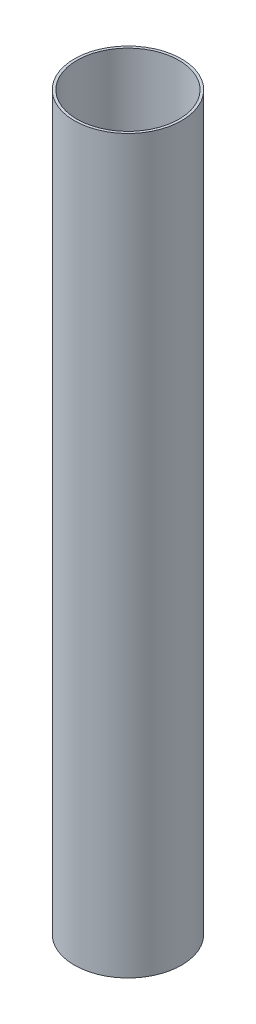
ISO-10303-21;
HEADER;
FILE_DESCRIPTION(('STEP AP214'),'2;1');
FILE_NAME('part.step','',(''),(''),'','','');
FILE_SCHEMA(('AUTOMOTIVE_DESIGN { 1 0 10303 214 1 1 1 1 }'));
ENDSEC;
DATA;
#1=APPLICATION_CONTEXT('core data for automotive mechanical design processes');
#2=APPLICATION_PROTOCOL_DEFINITION('international standard','automotive_design',2000,#1);
#3=PRODUCT_CONTEXT('',#1,'mechanical');
#4=PRODUCT('Part','Part','',(#3));
#5=PRODUCT_RELATED_PRODUCT_CATEGORY('part','',(#4));
#6=PRODUCT_DEFINITION_FORMATION('','',#4);
#7=PRODUCT_DEFINITION_CONTEXT('part definition',#1,'design');
#8=PRODUCT_DEFINITION('design','',#6,#7);
#9=PRODUCT_DEFINITION_SHAPE('','',#8);
#10=(LENGTH_UNIT() NAMED_UNIT(*) SI_UNIT(.MILLI.,.METRE.));
#11=(NAMED_UNIT(*) PLANE_ANGLE_UNIT() SI_UNIT($,.RADIAN.));
#12=(NAMED_UNIT(*) SI_UNIT($,.STERADIAN.) SOLID_ANGLE_UNIT());
#13=UNCERTAINTY_MEASURE_WITH_UNIT(LENGTH_MEASURE(1.E-05),#10,'distance_accuracy_value','');
#14=(GEOMETRIC_REPRESENTATION_CONTEXT(3) GLOBAL_UNCERTAINTY_ASSIGNED_CONTEXT((#13)) GLOBAL_UNIT_ASSIGNED_CONTEXT((#10,
#11,#12)) REPRESENTATION_CONTEXT('',''));
#15=CARTESIAN_POINT('',(0.,0.,0.));
#16=DIRECTION('',(0.,0.,1.));
#17=DIRECTION('',(1.,0.,0.));
#18=AXIS2_PLACEMENT_3D('',#15,#16,#17);
#19=CARTESIAN_POINT('',(0.,546.1,0.));
#20=DIRECTION('',(0.,-1.,0.));
#21=DIRECTION('',(0.,0.,-1.));
#22=AXIS2_PLACEMENT_3D('',#19,#20,#21);
#23=CYLINDRICAL_SURFACE('',#22,40.005);
#24=CARTESIAN_POINT('',(0.,546.1,0.));
#25=DIRECTION('',(0.,1.,0.));
#26=DIRECTION('',(0.,0.,1.));
#27=AXIS2_PLACEMENT_3D('',#24,#25,#26);
#28=CIRCLE('',#27,40.005);
#29=CARTESIAN_POINT('',(0.,546.1,40.005));
#30=VERTEX_POINT('',#29);
#31=EDGE_CURVE('E10',#30,#30,#28,.T.);
#32=ORIENTED_EDGE('',*,*,#31,.F.);
#33=EDGE_LOOP('',(#32));
#34=FACE_BOUND('',#33,.T.);
#35=CARTESIAN_POINT('',(0.,0.,0.));
#36=DIRECTION('',(0.,1.,0.));
#37=DIRECTION('',(0.,0.,1.));
#38=AXIS2_PLACEMENT_3D('',#35,#36,#37);
#39=CIRCLE('',#38,40.005);
#40=CARTESIAN_POINT('',(0.,0.,40.005));
#41=VERTEX_POINT('',#40);
#42=EDGE_CURVE('E43',#41,#41,#39,.T.);
#43=ORIENTED_EDGE('',*,*,#42,.T.);
#44=EDGE_LOOP('',(#43));
#45=FACE_BOUND('',#44,.T.);
#46=ADVANCED_FACE('F40',(#34,#45),#23,.T.);
#47=CARTESIAN_POINT('',(0.,546.1,0.));
#48=DIRECTION('',(0.,1.,0.));
#49=DIRECTION('',(0.,0.,1.));
#50=AXIS2_PLACEMENT_3D('',#47,#48,#49);
#51=PLANE('',#50);
#52=CARTESIAN_POINT('',(0.,546.1,0.));
#53=DIRECTION('',(0.,1.,0.));
#54=DIRECTION('',(0.,0.,1.));
#55=AXIS2_PLACEMENT_3D('',#52,#53,#54);
#56=CIRCLE('',#55,38.1);
#57=CARTESIAN_POINT('',(0.,546.1,38.1));
#58=VERTEX_POINT('',#57);
#59=EDGE_CURVE('E54',#58,#58,#56,.T.);
#60=ORIENTED_EDGE('',*,*,#59,.F.);
#61=EDGE_LOOP('',(#60));
#62=FACE_BOUND('',#61,.T.);
#63=ORIENTED_EDGE('',*,*,#31,.T.);
#64=EDGE_LOOP('',(#63));
#65=FACE_BOUND('',#64,.T.);
#66=ADVANCED_FACE('F71',(#62,#65),#51,.T.);
#67=CARTESIAN_POINT('',(0.,0.,0.));
#68=DIRECTION('',(0.,1.,0.));
#69=DIRECTION('',(0.,0.,1.));
#70=AXIS2_PLACEMENT_3D('',#67,#68,#69);
#71=PLANE('',#70);
#72=CARTESIAN_POINT('',(0.,0.,0.));
#73=DIRECTION('',(0.,1.,0.));
#74=DIRECTION('',(0.,0.,1.));
#75=AXIS2_PLACEMENT_3D('',#72,#73,#74);
#76=CIRCLE('',#75,38.1);
#77=CARTESIAN_POINT('',(0.,0.,38.1));
#78=VERTEX_POINT('',#77);
#79=EDGE_CURVE('E52',#78,#78,#76,.T.);
#80=ORIENTED_EDGE('',*,*,#79,.T.);
#81=EDGE_LOOP('',(#80));
#82=FACE_BOUND('',#81,.T.);
#83=ORIENTED_EDGE('',*,*,#42,.F.);
#84=EDGE_LOOP('',(#83));
#85=FACE_BOUND('',#84,.T.);
#86=ADVANCED_FACE('F62',(#82,#85),#71,.F.);
#87=CARTESIAN_POINT('',(0.,0.,0.));
#88=DIRECTION('',(0.,1.,0.));
#89=DIRECTION('',(0.,0.,1.));
#90=AXIS2_PLACEMENT_3D('',#87,#88,#89);
#91=CYLINDRICAL_SURFACE('',#90,38.1);
#92=ORIENTED_EDGE('',*,*,#79,.F.);
#93=EDGE_LOOP('',(#92));
#94=FACE_BOUND('',#93,.T.);
#95=ORIENTED_EDGE('',*,*,#59,.T.);
#96=EDGE_LOOP('',(#95));
#97=FACE_BOUND('',#96,.T.);
#98=ADVANCED_FACE('F65',(#94,#97),#91,.F.);
#99=CLOSED_SHELL('',(#46,#66,#86,#98));
#100=MANIFOLD_SOLID_BREP('B2',#99);
#101=ADVANCED_BREP_SHAPE_REPRESENTATION('',(#18,#100),#14);
#102=SHAPE_DEFINITION_REPRESENTATION(#9,#101);
ENDSEC;
END-ISO-10303-21;
